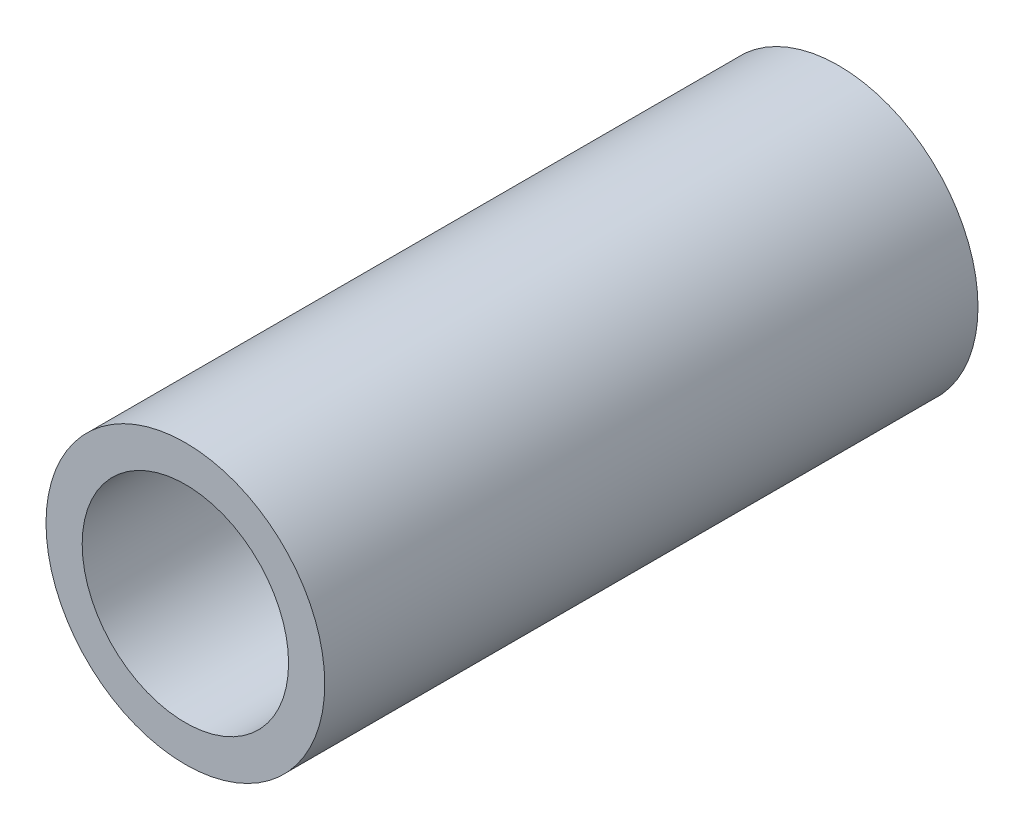
ISO-10303-21;
HEADER;
FILE_DESCRIPTION(('STEP AP214'),'2;1');
FILE_NAME('part.step','',(''),(''),'','','');
FILE_SCHEMA(('AUTOMOTIVE_DESIGN { 1 0 10303 214 1 1 1 1 }'));
ENDSEC;
DATA;
#1=APPLICATION_CONTEXT('core data for automotive mechanical design processes');
#2=APPLICATION_PROTOCOL_DEFINITION('international standard','automotive_design',2000,#1);
#3=PRODUCT_CONTEXT('',#1,'mechanical');
#4=PRODUCT('Part','Part','',(#3));
#5=PRODUCT_RELATED_PRODUCT_CATEGORY('part','',(#4));
#6=PRODUCT_DEFINITION_FORMATION('','',#4);
#7=PRODUCT_DEFINITION_CONTEXT('part definition',#1,'design');
#8=PRODUCT_DEFINITION('design','',#6,#7);
#9=PRODUCT_DEFINITION_SHAPE('','',#8);
#10=(LENGTH_UNIT() NAMED_UNIT(*) SI_UNIT(.MILLI.,.METRE.));
#11=(NAMED_UNIT(*) PLANE_ANGLE_UNIT() SI_UNIT($,.RADIAN.));
#12=(NAMED_UNIT(*) SI_UNIT($,.STERADIAN.) SOLID_ANGLE_UNIT());
#13=UNCERTAINTY_MEASURE_WITH_UNIT(LENGTH_MEASURE(1.E-05),#10,'distance_accuracy_value','');
#14=(GEOMETRIC_REPRESENTATION_CONTEXT(3) GLOBAL_UNCERTAINTY_ASSIGNED_CONTEXT((#13)) GLOBAL_UNIT_ASSIGNED_CONTEXT((#10,
#11,#12)) REPRESENTATION_CONTEXT('',''));
#15=CARTESIAN_POINT('',(0.,0.,0.));
#16=DIRECTION('',(0.,0.,1.));
#17=DIRECTION('',(1.,0.,0.));
#18=AXIS2_PLACEMENT_3D('',#15,#16,#17);
#19=CARTESIAN_POINT('',(0.,0.,25.));
#20=DIRECTION('',(0.,0.,1.));
#21=DIRECTION('',(1.,0.,0.));
#22=AXIS2_PLACEMENT_3D('',#19,#20,#21);
#23=PLANE('',#22);
#24=CARTESIAN_POINT('',(0.,0.,25.));
#25=DIRECTION('',(0.,0.,1.));
#26=DIRECTION('',(1.,0.,0.));
#27=AXIS2_PLACEMENT_3D('',#24,#25,#26);
#28=CIRCLE('',#27,10.668);
#29=CARTESIAN_POINT('',(10.668,0.,25.));
#30=VERTEX_POINT('',#29);
#31=EDGE_CURVE('E11',#30,#30,#28,.T.);
#32=ORIENTED_EDGE('',*,*,#31,.T.);
#33=EDGE_LOOP('',(#32));
#34=FACE_BOUND('',#33,.T.);
#35=CARTESIAN_POINT('',(0.,0.,25.));
#36=DIRECTION('',(0.,0.,1.));
#37=DIRECTION('',(1.,0.,0.));
#38=AXIS2_PLACEMENT_3D('',#35,#36,#37);
#39=CIRCLE('',#38,7.8994);
#40=CARTESIAN_POINT('',(7.8994,0.,25.));
#41=VERTEX_POINT('',#40);
#42=EDGE_CURVE('E48',#41,#41,#39,.T.);
#43=ORIENTED_EDGE('',*,*,#42,.F.);
#44=EDGE_LOOP('',(#43));
#45=FACE_BOUND('',#44,.T.);
#46=ADVANCED_FACE('F37',(#34,#45),#23,.T.);
#47=CARTESIAN_POINT('',(0.,0.,-25.));
#48=DIRECTION('',(0.,0.,1.));
#49=DIRECTION('',(1.,0.,0.));
#50=AXIS2_PLACEMENT_3D('',#47,#48,#49);
#51=PLANE('',#50);
#52=CARTESIAN_POINT('',(0.,0.,-25.));
#53=DIRECTION('',(0.,0.,1.));
#54=DIRECTION('',(1.,0.,0.));
#55=AXIS2_PLACEMENT_3D('',#52,#53,#54);
#56=CIRCLE('',#55,10.668);
#57=CARTESIAN_POINT('',(10.668,0.,-25.));
#58=VERTEX_POINT('',#57);
#59=EDGE_CURVE('E41',#58,#58,#56,.T.);
#60=ORIENTED_EDGE('',*,*,#59,.F.);
#61=EDGE_LOOP('',(#60));
#62=FACE_BOUND('',#61,.T.);
#63=CARTESIAN_POINT('',(0.,0.,-25.));
#64=DIRECTION('',(0.,0.,1.));
#65=DIRECTION('',(1.,0.,0.));
#66=AXIS2_PLACEMENT_3D('',#63,#64,#65);
#67=CIRCLE('',#66,7.8994);
#68=CARTESIAN_POINT('',(7.8994,0.,-25.));
#69=VERTEX_POINT('',#68);
#70=EDGE_CURVE('E50',#69,#69,#67,.T.);
#71=ORIENTED_EDGE('',*,*,#70,.T.);
#72=EDGE_LOOP('',(#71));
#73=FACE_BOUND('',#72,.T.);
#74=ADVANCED_FACE('F60',(#62,#73),#51,.F.);
#75=CARTESIAN_POINT('',(0.,0.,25.));
#76=DIRECTION('',(0.,0.,-1.));
#77=DIRECTION('',(-1.,0.,0.));
#78=AXIS2_PLACEMENT_3D('',#75,#76,#77);
#79=CYLINDRICAL_SURFACE('',#78,10.668);
#80=ORIENTED_EDGE('',*,*,#31,.F.);
#81=EDGE_LOOP('',(#80));
#82=FACE_BOUND('',#81,.T.);
#83=ORIENTED_EDGE('',*,*,#59,.T.);
#84=EDGE_LOOP('',(#83));
#85=FACE_BOUND('',#84,.T.);
#86=ADVANCED_FACE('F39',(#82,#85),#79,.T.);
#87=CARTESIAN_POINT('',(0.,0.,25.));
#88=DIRECTION('',(0.,0.,-1.));
#89=DIRECTION('',(-1.,0.,0.));
#90=AXIS2_PLACEMENT_3D('',#87,#88,#89);
#91=CYLINDRICAL_SURFACE('',#90,7.8994);
#92=ORIENTED_EDGE('',*,*,#42,.T.);
#93=EDGE_LOOP('',(#92));
#94=FACE_BOUND('',#93,.T.);
#95=ORIENTED_EDGE('',*,*,#70,.F.);
#96=EDGE_LOOP('',(#95));
#97=FACE_BOUND('',#96,.T.);
#98=ADVANCED_FACE('F56',(#94,#97),#91,.F.);
#99=CLOSED_SHELL('',(#46,#74,#86,#98));
#100=MANIFOLD_SOLID_BREP('B2',#99);
#101=ADVANCED_BREP_SHAPE_REPRESENTATION('',(#18,#100),#14);
#102=SHAPE_DEFINITION_REPRESENTATION(#9,#101);
ENDSEC;
END-ISO-10303-21;
